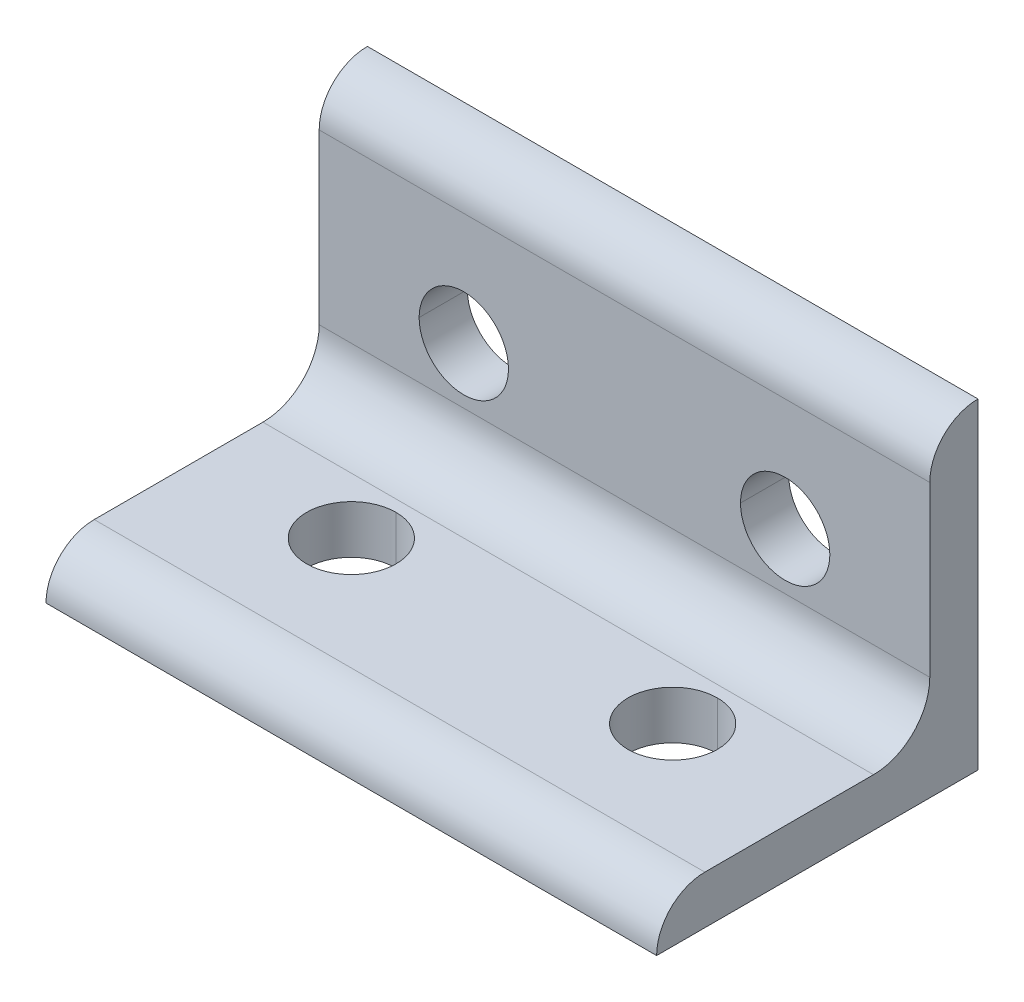
ISO-10303-21;
HEADER;
FILE_DESCRIPTION(('STEP AP214'),'2;1');
FILE_NAME('part.step','',(''),(''),'','','');
FILE_SCHEMA(('AUTOMOTIVE_DESIGN { 1 0 10303 214 1 1 1 1 }'));
ENDSEC;
DATA;
#1=APPLICATION_CONTEXT('core data for automotive mechanical design processes');
#2=APPLICATION_PROTOCOL_DEFINITION('international standard','automotive_design',2000,#1);
#3=PRODUCT_CONTEXT('',#1,'mechanical');
#4=PRODUCT('Part','Part','',(#3));
#5=PRODUCT_RELATED_PRODUCT_CATEGORY('part','',(#4));
#6=PRODUCT_DEFINITION_FORMATION('','',#4);
#7=PRODUCT_DEFINITION_CONTEXT('part definition',#1,'design');
#8=PRODUCT_DEFINITION('design','',#6,#7);
#9=PRODUCT_DEFINITION_SHAPE('','',#8);
#10=(LENGTH_UNIT() NAMED_UNIT(*) SI_UNIT(.MILLI.,.METRE.));
#11=(NAMED_UNIT(*) PLANE_ANGLE_UNIT() SI_UNIT($,.RADIAN.));
#12=(NAMED_UNIT(*) SI_UNIT($,.STERADIAN.) SOLID_ANGLE_UNIT());
#13=UNCERTAINTY_MEASURE_WITH_UNIT(LENGTH_MEASURE(1.E-05),#10,'distance_accuracy_value','');
#14=(GEOMETRIC_REPRESENTATION_CONTEXT(3) GLOBAL_UNCERTAINTY_ASSIGNED_CONTEXT((#13)) GLOBAL_UNIT_ASSIGNED_CONTEXT((#10,
#11,#12)) REPRESENTATION_CONTEXT('',''));
#15=CARTESIAN_POINT('',(0.,0.,0.));
#16=DIRECTION('',(0.,0.,1.));
#17=DIRECTION('',(1.,0.,0.));
#18=AXIS2_PLACEMENT_3D('',#15,#16,#17);
#19=CARTESIAN_POINT('',(19.,5.38631639290799E-13,17.0000000000006));
#20=DIRECTION('',(-1.,0.,0.));
#21=DIRECTION('',(0.,-0.707106781186549,-0.707106781186546));
#22=AXIS2_PLACEMENT_3D('',#19,#20,#21);
#23=CYLINDRICAL_SURFACE('',#22,2.99999999999946);
#24=CARTESIAN_POINT('',(-19.,5.38631639290799E-13,17.0000000000006));
#25=DIRECTION('',(1.,0.,0.));
#26=DIRECTION('',(0.,0.,-1.));
#27=AXIS2_PLACEMENT_3D('',#24,#25,#26);
#28=CIRCLE('',#27,2.99999999999946);
#29=CARTESIAN_POINT('',(-19.,3.,17.));
#30=VERTEX_POINT('',#29);
#31=CARTESIAN_POINT('',(-19.,0.,20.));
#32=VERTEX_POINT('',#31);
#33=EDGE_CURVE('E11',#30,#32,#28,.T.);
#34=ORIENTED_EDGE('',*,*,#33,.T.);
#35=DIRECTION('',(-1.,0.,0.));
#36=VECTOR('',#35,1.);
#37=CARTESIAN_POINT('',(19.,0.,20.));
#38=LINE('',#37,#36);
#39=CARTESIAN_POINT('',(19.,0.,20.));
#40=VERTEX_POINT('',#39);
#41=EDGE_CURVE('E24',#40,#32,#38,.T.);
#42=ORIENTED_EDGE('',*,*,#41,.F.);
#43=CARTESIAN_POINT('',(19.,5.38631639290799E-13,17.0000000000006));
#44=DIRECTION('',(1.,0.,0.));
#45=DIRECTION('',(0.,0.,-1.));
#46=AXIS2_PLACEMENT_3D('',#43,#44,#45);
#47=CIRCLE('',#46,2.99999999999946);
#48=CARTESIAN_POINT('',(19.,3.,17.));
#49=VERTEX_POINT('',#48);
#50=EDGE_CURVE('E297',#49,#40,#47,.T.);
#51=ORIENTED_EDGE('',*,*,#50,.F.);
#52=DIRECTION('',(-1.,0.,0.));
#53=VECTOR('',#52,1.);
#54=CARTESIAN_POINT('',(19.,3.,17.));
#55=LINE('',#54,#53);
#56=EDGE_CURVE('E293',#49,#30,#55,.T.);
#57=ORIENTED_EDGE('',*,*,#56,.T.);
#58=EDGE_LOOP('',(#34,#42,#51,#57));
#59=FACE_BOUND('',#58,.T.);
#60=ADVANCED_FACE('F16',(#59),#23,.T.);
#61=CARTESIAN_POINT('',(19.,3.,6.5));
#62=DIRECTION('',(0.,-1.,0.));
#63=DIRECTION('',(0.,0.,-1.));
#64=AXIS2_PLACEMENT_3D('',#61,#62,#63);
#65=PLANE('',#64);
#66=CARTESIAN_POINT('',(-10.,3.,10.));
#67=DIRECTION('',(0.,1.,0.));
#68=DIRECTION('',(0.,0.,-1.));
#69=AXIS2_PLACEMENT_3D('',#66,#67,#68);
#70=CIRCLE('',#69,2.78);
#71=CARTESIAN_POINT('',(-10.,3.,12.78));
#72=VERTEX_POINT('',#71);
#73=CARTESIAN_POINT('',(-10.,3.,7.22));
#74=VERTEX_POINT('',#73);
#75=EDGE_CURVE('E288',#72,#74,#70,.T.);
#76=ORIENTED_EDGE('',*,*,#75,.F.);
#77=CARTESIAN_POINT('',(-10.,3.,10.));
#78=DIRECTION('',(0.,1.,0.));
#79=DIRECTION('',(0.,0.,-1.));
#80=AXIS2_PLACEMENT_3D('',#77,#78,#79);
#81=CIRCLE('',#80,2.78);
#82=EDGE_CURVE('E283',#74,#72,#81,.T.);
#83=ORIENTED_EDGE('',*,*,#82,.F.);
#84=EDGE_LOOP('',(#76,#83));
#85=FACE_BOUND('',#84,.T.);
#86=CARTESIAN_POINT('',(10.,3.,10.));
#87=DIRECTION('',(0.,1.,0.));
#88=DIRECTION('',(0.,0.,-1.));
#89=AXIS2_PLACEMENT_3D('',#86,#87,#88);
#90=CIRCLE('',#89,2.78);
#91=CARTESIAN_POINT('',(10.,3.,12.78));
#92=VERTEX_POINT('',#91);
#93=CARTESIAN_POINT('',(10.,3.,7.22));
#94=VERTEX_POINT('',#93);
#95=EDGE_CURVE('E139',#92,#94,#90,.T.);
#96=ORIENTED_EDGE('',*,*,#95,.F.);
#97=CARTESIAN_POINT('',(10.,3.,10.));
#98=DIRECTION('',(0.,1.,0.));
#99=DIRECTION('',(0.,0.,-1.));
#100=AXIS2_PLACEMENT_3D('',#97,#98,#99);
#101=CIRCLE('',#100,2.78);
#102=EDGE_CURVE('E276',#94,#92,#101,.T.);
#103=ORIENTED_EDGE('',*,*,#102,.F.);
#104=EDGE_LOOP('',(#96,#103));
#105=FACE_BOUND('',#104,.T.);
#106=DIRECTION('',(0.,0.,1.));
#107=VECTOR('',#106,1.);
#108=CARTESIAN_POINT('',(-19.,3.,6.5));
#109=LINE('',#108,#107);
#110=CARTESIAN_POINT('',(-19.,3.,6.5));
#111=VERTEX_POINT('',#110);
#112=EDGE_CURVE('E271',#111,#30,#109,.T.);
#113=ORIENTED_EDGE('',*,*,#112,.T.);
#114=ORIENTED_EDGE('',*,*,#56,.F.);
#115=DIRECTION('',(0.,0.,1.));
#116=VECTOR('',#115,1.);
#117=CARTESIAN_POINT('',(19.,3.,6.5));
#118=LINE('',#117,#116);
#119=CARTESIAN_POINT('',(19.,3.,6.5));
#120=VERTEX_POINT('',#119);
#121=EDGE_CURVE('E266',#120,#49,#118,.T.);
#122=ORIENTED_EDGE('',*,*,#121,.F.);
#123=DIRECTION('',(-1.,0.,0.));
#124=VECTOR('',#123,1.);
#125=CARTESIAN_POINT('',(19.,3.,6.5));
#126=LINE('',#125,#124);
#127=EDGE_CURVE('E262',#120,#111,#126,.T.);
#128=ORIENTED_EDGE('',*,*,#127,.T.);
#129=EDGE_LOOP('',(#113,#114,#122,#128));
#130=FACE_BOUND('',#129,.T.);
#131=ADVANCED_FACE('F313',(#85,#105,#130),#65,.F.);
#132=CARTESIAN_POINT('',(19.,6.5,6.5));
#133=DIRECTION('',(-1.,0.,0.));
#134=DIRECTION('',(0.,0.707106781186547,0.707106781186548));
#135=AXIS2_PLACEMENT_3D('',#132,#133,#134);
#136=CYLINDRICAL_SURFACE('',#135,3.50000000000006);
#137=CARTESIAN_POINT('',(-19.,6.5,6.5));
#138=DIRECTION('',(1.,0.,0.));
#139=DIRECTION('',(0.,0.,-1.));
#140=AXIS2_PLACEMENT_3D('',#137,#138,#139);
#141=CIRCLE('',#140,3.50000000000006);
#142=CARTESIAN_POINT('',(-19.,6.5,3.));
#143=VERTEX_POINT('',#142);
#144=EDGE_CURVE('E257',#111,#143,#141,.T.);
#145=ORIENTED_EDGE('',*,*,#144,.F.);
#146=ORIENTED_EDGE('',*,*,#127,.F.);
#147=CARTESIAN_POINT('',(19.,6.5,6.5));
#148=DIRECTION('',(1.,0.,0.));
#149=DIRECTION('',(0.,0.,-1.));
#150=AXIS2_PLACEMENT_3D('',#147,#148,#149);
#151=CIRCLE('',#150,3.50000000000006);
#152=CARTESIAN_POINT('',(19.,6.5,3.));
#153=VERTEX_POINT('',#152);
#154=EDGE_CURVE('E253',#120,#153,#151,.T.);
#155=ORIENTED_EDGE('',*,*,#154,.T.);
#156=DIRECTION('',(-1.,0.,0.));
#157=VECTOR('',#156,1.);
#158=CARTESIAN_POINT('',(19.,6.5,3.));
#159=LINE('',#158,#157);
#160=EDGE_CURVE('E249',#153,#143,#159,.T.);
#161=ORIENTED_EDGE('',*,*,#160,.T.);
#162=EDGE_LOOP('',(#145,#146,#155,#161));
#163=FACE_BOUND('',#162,.T.);
#164=ADVANCED_FACE('F331',(#163),#136,.F.);
#165=CARTESIAN_POINT('',(19.,17.,3.));
#166=DIRECTION('',(0.,0.,-1.));
#167=DIRECTION('',(-1.,0.,0.));
#168=AXIS2_PLACEMENT_3D('',#165,#166,#167);
#169=PLANE('',#168);
#170=CARTESIAN_POINT('',(-10.,10.,3.));
#171=DIRECTION('',(0.,0.,1.));
#172=DIRECTION('',(-1.,0.,0.));
#173=AXIS2_PLACEMENT_3D('',#170,#171,#172);
#174=CIRCLE('',#173,2.78);
#175=CARTESIAN_POINT('',(-7.22,10.,3.));
#176=VERTEX_POINT('',#175);
#177=CARTESIAN_POINT('',(-12.78,10.,3.));
#178=VERTEX_POINT('',#177);
#179=EDGE_CURVE('E244',#176,#178,#174,.T.);
#180=ORIENTED_EDGE('',*,*,#179,.F.);
#181=CARTESIAN_POINT('',(-10.,10.,3.));
#182=DIRECTION('',(0.,0.,1.));
#183=DIRECTION('',(-1.,0.,0.));
#184=AXIS2_PLACEMENT_3D('',#181,#182,#183);
#185=CIRCLE('',#184,2.78);
#186=EDGE_CURVE('E239',#178,#176,#185,.T.);
#187=ORIENTED_EDGE('',*,*,#186,.F.);
#188=EDGE_LOOP('',(#180,#187));
#189=FACE_BOUND('',#188,.T.);
#190=CARTESIAN_POINT('',(10.,10.,3.));
#191=DIRECTION('',(0.,0.,1.));
#192=DIRECTION('',(-1.,0.,0.));
#193=AXIS2_PLACEMENT_3D('',#190,#191,#192);
#194=CIRCLE('',#193,2.78);
#195=CARTESIAN_POINT('',(12.78,10.,3.));
#196=VERTEX_POINT('',#195);
#197=CARTESIAN_POINT('',(7.22,10.,3.));
#198=VERTEX_POINT('',#197);
#199=EDGE_CURVE('E234',#196,#198,#194,.T.);
#200=ORIENTED_EDGE('',*,*,#199,.F.);
#201=CARTESIAN_POINT('',(10.,10.,3.));
#202=DIRECTION('',(0.,0.,1.));
#203=DIRECTION('',(-1.,0.,0.));
#204=AXIS2_PLACEMENT_3D('',#201,#202,#203);
#205=CIRCLE('',#204,2.78);
#206=EDGE_CURVE('E229',#198,#196,#205,.T.);
#207=ORIENTED_EDGE('',*,*,#206,.F.);
#208=EDGE_LOOP('',(#200,#207));
#209=FACE_BOUND('',#208,.T.);
#210=DIRECTION('',(0.,-1.,0.));
#211=VECTOR('',#210,1.);
#212=CARTESIAN_POINT('',(-19.,17.,3.));
#213=LINE('',#212,#211);
#214=CARTESIAN_POINT('',(-19.,17.,3.));
#215=VERTEX_POINT('',#214);
#216=EDGE_CURVE('E224',#215,#143,#213,.T.);
#217=ORIENTED_EDGE('',*,*,#216,.T.);
#218=ORIENTED_EDGE('',*,*,#160,.F.);
#219=DIRECTION('',(0.,-1.,0.));
#220=VECTOR('',#219,1.);
#221=CARTESIAN_POINT('',(19.,17.,3.));
#222=LINE('',#221,#220);
#223=CARTESIAN_POINT('',(19.,17.,3.));
#224=VERTEX_POINT('',#223);
#225=EDGE_CURVE('E219',#224,#153,#222,.T.);
#226=ORIENTED_EDGE('',*,*,#225,.F.);
#227=DIRECTION('',(-1.,0.,0.));
#228=VECTOR('',#227,1.);
#229=CARTESIAN_POINT('',(19.,17.,3.));
#230=LINE('',#229,#228);
#231=EDGE_CURVE('E215',#224,#215,#230,.T.);
#232=ORIENTED_EDGE('',*,*,#231,.T.);
#233=EDGE_LOOP('',(#217,#218,#226,#232));
#234=FACE_BOUND('',#233,.T.);
#235=ADVANCED_FACE('F329',(#189,#209,#234),#169,.F.);
#236=CARTESIAN_POINT('',(19.,17.0000000000006,5.38197958421804E-13));
#237=DIRECTION('',(-1.,0.,0.));
#238=DIRECTION('',(0.,-0.707106781186546,-0.707106781186549));
#239=AXIS2_PLACEMENT_3D('',#236,#237,#238);
#240=CYLINDRICAL_SURFACE('',#239,2.99999999999946);
#241=CARTESIAN_POINT('',(-19.,17.0000000000006,5.38197958421804E-13));
#242=DIRECTION('',(1.,0.,0.));
#243=DIRECTION('',(0.,0.,-1.));
#244=AXIS2_PLACEMENT_3D('',#241,#242,#243);
#245=CIRCLE('',#244,2.99999999999946);
#246=CARTESIAN_POINT('',(-19.,20.,0.));
#247=VERTEX_POINT('',#246);
#248=EDGE_CURVE('E210',#247,#215,#245,.T.);
#249=ORIENTED_EDGE('',*,*,#248,.T.);
#250=ORIENTED_EDGE('',*,*,#231,.F.);
#251=CARTESIAN_POINT('',(19.,17.0000000000006,5.38197958421804E-13));
#252=DIRECTION('',(1.,0.,0.));
#253=DIRECTION('',(0.,0.,-1.));
#254=AXIS2_PLACEMENT_3D('',#251,#252,#253);
#255=CIRCLE('',#254,2.99999999999946);
#256=CARTESIAN_POINT('',(19.,20.,0.));
#257=VERTEX_POINT('',#256);
#258=EDGE_CURVE('E205',#257,#224,#255,.T.);
#259=ORIENTED_EDGE('',*,*,#258,.F.);
#260=DIRECTION('',(-1.,0.,0.));
#261=VECTOR('',#260,1.);
#262=CARTESIAN_POINT('',(19.,20.,0.));
#263=LINE('',#262,#261);
#264=EDGE_CURVE('E201',#257,#247,#263,.T.);
#265=ORIENTED_EDGE('',*,*,#264,.T.);
#266=EDGE_LOOP('',(#249,#250,#259,#265));
#267=FACE_BOUND('',#266,.T.);
#268=ADVANCED_FACE('F327',(#267),#240,.T.);
#269=CARTESIAN_POINT('',(19.,0.,0.));
#270=DIRECTION('',(0.,0.,1.));
#271=DIRECTION('',(1.,0.,0.));
#272=AXIS2_PLACEMENT_3D('',#269,#270,#271);
#273=PLANE('',#272);
#274=CARTESIAN_POINT('',(-10.,10.,0.));
#275=DIRECTION('',(0.,0.,1.));
#276=DIRECTION('',(1.,0.,0.));
#277=AXIS2_PLACEMENT_3D('',#274,#275,#276);
#278=CIRCLE('',#277,2.78);
#279=CARTESIAN_POINT('',(-7.22,10.,0.));
#280=VERTEX_POINT('',#279);
#281=CARTESIAN_POINT('',(-12.78,10.,0.));
#282=VERTEX_POINT('',#281);
#283=EDGE_CURVE('E197',#280,#282,#278,.T.);
#284=ORIENTED_EDGE('',*,*,#283,.T.);
#285=CARTESIAN_POINT('',(-10.,10.,0.));
#286=DIRECTION('',(0.,0.,1.));
#287=DIRECTION('',(1.,0.,0.));
#288=AXIS2_PLACEMENT_3D('',#285,#286,#287);
#289=CIRCLE('',#288,2.78);
#290=EDGE_CURVE('E193',#282,#280,#289,.T.);
#291=ORIENTED_EDGE('',*,*,#290,.T.);
#292=EDGE_LOOP('',(#284,#291));
#293=FACE_BOUND('',#292,.T.);
#294=CARTESIAN_POINT('',(10.,10.,0.));
#295=DIRECTION('',(0.,0.,1.));
#296=DIRECTION('',(1.,0.,0.));
#297=AXIS2_PLACEMENT_3D('',#294,#295,#296);
#298=CIRCLE('',#297,2.78);
#299=CARTESIAN_POINT('',(12.78,10.,0.));
#300=VERTEX_POINT('',#299);
#301=CARTESIAN_POINT('',(7.22,10.,0.));
#302=VERTEX_POINT('',#301);
#303=EDGE_CURVE('E189',#300,#302,#298,.T.);
#304=ORIENTED_EDGE('',*,*,#303,.T.);
#305=CARTESIAN_POINT('',(10.,10.,0.));
#306=DIRECTION('',(0.,0.,1.));
#307=DIRECTION('',(1.,0.,0.));
#308=AXIS2_PLACEMENT_3D('',#305,#306,#307);
#309=CIRCLE('',#308,2.78);
#310=EDGE_CURVE('E185',#302,#300,#309,.T.);
#311=ORIENTED_EDGE('',*,*,#310,.T.);
#312=EDGE_LOOP('',(#304,#311));
#313=FACE_BOUND('',#312,.T.);
#314=DIRECTION('',(0.,1.,0.));
#315=VECTOR('',#314,1.);
#316=CARTESIAN_POINT('',(-19.,0.,0.));
#317=LINE('',#316,#315);
#318=CARTESIAN_POINT('',(-19.,0.,0.));
#319=VERTEX_POINT('',#318);
#320=EDGE_CURVE('E180',#319,#247,#317,.T.);
#321=ORIENTED_EDGE('',*,*,#320,.T.);
#322=ORIENTED_EDGE('',*,*,#264,.F.);
#323=DIRECTION('',(0.,1.,0.));
#324=VECTOR('',#323,1.);
#325=CARTESIAN_POINT('',(19.,0.,0.));
#326=LINE('',#325,#324);
#327=CARTESIAN_POINT('',(19.,0.,0.));
#328=VERTEX_POINT('',#327);
#329=EDGE_CURVE('E175',#328,#257,#326,.T.);
#330=ORIENTED_EDGE('',*,*,#329,.F.);
#331=DIRECTION('',(-1.,0.,0.));
#332=VECTOR('',#331,1.);
#333=CARTESIAN_POINT('',(19.,0.,0.));
#334=LINE('',#333,#332);
#335=EDGE_CURVE('E171',#328,#319,#334,.T.);
#336=ORIENTED_EDGE('',*,*,#335,.T.);
#337=EDGE_LOOP('',(#321,#322,#330,#336));
#338=FACE_BOUND('',#337,.T.);
#339=ADVANCED_FACE('F323',(#293,#313,#338),#273,.F.);
#340=CARTESIAN_POINT('',(19.,0.,20.));
#341=DIRECTION('',(0.,1.,0.));
#342=DIRECTION('',(0.,0.,1.));
#343=AXIS2_PLACEMENT_3D('',#340,#341,#342);
#344=PLANE('',#343);
#345=CARTESIAN_POINT('',(-10.,0.,10.));
#346=DIRECTION('',(0.,1.,0.));
#347=DIRECTION('',(1.,0.,0.));
#348=AXIS2_PLACEMENT_3D('',#345,#346,#347);
#349=CIRCLE('',#348,2.78);
#350=CARTESIAN_POINT('',(-10.,0.,7.22));
#351=VERTEX_POINT('',#350);
#352=CARTESIAN_POINT('',(-10.,0.,12.78));
#353=VERTEX_POINT('',#352);
#354=EDGE_CURVE('E167',#351,#353,#349,.T.);
#355=ORIENTED_EDGE('',*,*,#354,.T.);
#356=CARTESIAN_POINT('',(-10.,0.,10.));
#357=DIRECTION('',(0.,1.,0.));
#358=DIRECTION('',(0.,0.,1.));
#359=AXIS2_PLACEMENT_3D('',#356,#357,#358);
#360=CIRCLE('',#359,2.78);
#361=EDGE_CURVE('E136',#353,#351,#360,.T.);
#362=ORIENTED_EDGE('',*,*,#361,.T.);
#363=EDGE_LOOP('',(#355,#362));
#364=FACE_BOUND('',#363,.T.);
#365=CARTESIAN_POINT('',(10.,0.,10.));
#366=DIRECTION('',(0.,1.,0.));
#367=DIRECTION('',(1.,0.,0.));
#368=AXIS2_PLACEMENT_3D('',#365,#366,#367);
#369=CIRCLE('',#368,2.78);
#370=CARTESIAN_POINT('',(10.,0.,7.22));
#371=VERTEX_POINT('',#370);
#372=CARTESIAN_POINT('',(10.,0.,12.78));
#373=VERTEX_POINT('',#372);
#374=EDGE_CURVE('E122',#371,#373,#369,.T.);
#375=ORIENTED_EDGE('',*,*,#374,.T.);
#376=CARTESIAN_POINT('',(10.,0.,10.));
#377=DIRECTION('',(0.,1.,0.));
#378=DIRECTION('',(0.,0.,1.));
#379=AXIS2_PLACEMENT_3D('',#376,#377,#378);
#380=CIRCLE('',#379,2.78);
#381=EDGE_CURVE('E118',#373,#371,#380,.T.);
#382=ORIENTED_EDGE('',*,*,#381,.T.);
#383=EDGE_LOOP('',(#375,#382));
#384=FACE_BOUND('',#383,.T.);
#385=DIRECTION('',(0.,0.,-1.));
#386=VECTOR('',#385,1.);
#387=CARTESIAN_POINT('',(-19.,0.,20.));
#388=LINE('',#387,#386);
#389=EDGE_CURVE('E127',#32,#319,#388,.T.);
#390=ORIENTED_EDGE('',*,*,#389,.T.);
#391=ORIENTED_EDGE('',*,*,#335,.F.);
#392=DIRECTION('',(0.,0.,-1.));
#393=VECTOR('',#392,1.);
#394=CARTESIAN_POINT('',(19.,0.,20.));
#395=LINE('',#394,#393);
#396=EDGE_CURVE('E142',#40,#328,#395,.T.);
#397=ORIENTED_EDGE('',*,*,#396,.F.);
#398=ORIENTED_EDGE('',*,*,#41,.T.);
#399=EDGE_LOOP('',(#390,#391,#397,#398));
#400=FACE_BOUND('',#399,.T.);
#401=ADVANCED_FACE('F120',(#364,#384,#400),#344,.F.);
#402=CARTESIAN_POINT('',(19.,5.38631639290799E-13,17.0000000000006));
#403=DIRECTION('',(1.,0.,0.));
#404=DIRECTION('',(0.,0.,-1.));
#405=AXIS2_PLACEMENT_3D('',#402,#403,#404);
#406=PLANE('',#405);
#407=ORIENTED_EDGE('',*,*,#50,.T.);
#408=ORIENTED_EDGE('',*,*,#396,.T.);
#409=ORIENTED_EDGE('',*,*,#329,.T.);
#410=ORIENTED_EDGE('',*,*,#258,.T.);
#411=ORIENTED_EDGE('',*,*,#225,.T.);
#412=ORIENTED_EDGE('',*,*,#154,.F.);
#413=ORIENTED_EDGE('',*,*,#121,.T.);
#414=EDGE_LOOP('',(#407,#408,#409,#410,#411,#412,#413));
#415=FACE_BOUND('',#414,.T.);
#416=ADVANCED_FACE('F309',(#415),#406,.T.);
#417=CARTESIAN_POINT('',(-19.,5.38631639290799E-13,17.0000000000006));
#418=DIRECTION('',(1.,0.,0.));
#419=DIRECTION('',(0.,0.,-1.));
#420=AXIS2_PLACEMENT_3D('',#417,#418,#419);
#421=PLANE('',#420);
#422=ORIENTED_EDGE('',*,*,#33,.F.);
#423=ORIENTED_EDGE('',*,*,#112,.F.);
#424=ORIENTED_EDGE('',*,*,#144,.T.);
#425=ORIENTED_EDGE('',*,*,#216,.F.);
#426=ORIENTED_EDGE('',*,*,#248,.F.);
#427=ORIENTED_EDGE('',*,*,#320,.F.);
#428=ORIENTED_EDGE('',*,*,#389,.F.);
#429=EDGE_LOOP('',(#422,#423,#424,#425,#426,#427,#428));
#430=FACE_BOUND('',#429,.T.);
#431=ADVANCED_FACE('F318',(#430),#421,.F.);
#432=CARTESIAN_POINT('',(10.,3.1,10.));
#433=DIRECTION('',(0.,-1.,0.));
#434=DIRECTION('',(-1.,0.,0.));
#435=AXIS2_PLACEMENT_3D('',#432,#433,#434);
#436=CYLINDRICAL_SURFACE('',#435,2.78);
#437=DIRECTION('',(0.,-1.,0.));
#438=VECTOR('',#437,1.);
#439=CARTESIAN_POINT('',(10.,3.,12.78));
#440=LINE('',#439,#438);
#441=EDGE_CURVE('E135',#92,#373,#440,.T.);
#442=ORIENTED_EDGE('',*,*,#441,.F.);
#443=ORIENTED_EDGE('',*,*,#95,.T.);
#444=DIRECTION('',(0.,-1.,0.));
#445=VECTOR('',#444,1.);
#446=CARTESIAN_POINT('',(10.,3.,7.22));
#447=LINE('',#446,#445);
#448=EDGE_CURVE('E133',#94,#371,#447,.T.);
#449=ORIENTED_EDGE('',*,*,#448,.T.);
#450=ORIENTED_EDGE('',*,*,#381,.F.);
#451=EDGE_LOOP('',(#442,#443,#449,#450));
#452=FACE_BOUND('',#451,.T.);
#453=ADVANCED_FACE('F138',(#452),#436,.F.);
#454=CARTESIAN_POINT('',(10.,3.1,10.));
#455=DIRECTION('',(0.,-1.,0.));
#456=DIRECTION('',(1.,0.,0.));
#457=AXIS2_PLACEMENT_3D('',#454,#455,#456);
#458=CYLINDRICAL_SURFACE('',#457,2.78);
#459=ORIENTED_EDGE('',*,*,#441,.T.);
#460=ORIENTED_EDGE('',*,*,#374,.F.);
#461=ORIENTED_EDGE('',*,*,#448,.F.);
#462=ORIENTED_EDGE('',*,*,#102,.T.);
#463=EDGE_LOOP('',(#459,#460,#461,#462));
#464=FACE_BOUND('',#463,.T.);
#465=ADVANCED_FACE('F131',(#464),#458,.F.);
#466=CARTESIAN_POINT('',(-10.,3.1,10.));
#467=DIRECTION('',(0.,-1.,0.));
#468=DIRECTION('',(-1.,0.,0.));
#469=AXIS2_PLACEMENT_3D('',#466,#467,#468);
#470=CYLINDRICAL_SURFACE('',#469,2.78);
#471=DIRECTION('',(0.,-1.,0.));
#472=VECTOR('',#471,1.);
#473=CARTESIAN_POINT('',(-10.,3.,12.78));
#474=LINE('',#473,#472);
#475=EDGE_CURVE('E140',#72,#353,#474,.T.);
#476=ORIENTED_EDGE('',*,*,#475,.F.);
#477=ORIENTED_EDGE('',*,*,#75,.T.);
#478=DIRECTION('',(0.,-1.,0.));
#479=VECTOR('',#478,1.);
#480=CARTESIAN_POINT('',(-10.,3.,7.22));
#481=LINE('',#480,#479);
#482=EDGE_CURVE('E145',#74,#351,#481,.T.);
#483=ORIENTED_EDGE('',*,*,#482,.T.);
#484=ORIENTED_EDGE('',*,*,#361,.F.);
#485=EDGE_LOOP('',(#476,#477,#483,#484));
#486=FACE_BOUND('',#485,.T.);
#487=ADVANCED_FACE('F423',(#486),#470,.F.);
#488=CARTESIAN_POINT('',(-10.,3.1,10.));
#489=DIRECTION('',(0.,-1.,0.));
#490=DIRECTION('',(1.,0.,0.));
#491=AXIS2_PLACEMENT_3D('',#488,#489,#490);
#492=CYLINDRICAL_SURFACE('',#491,2.78);
#493=ORIENTED_EDGE('',*,*,#475,.T.);
#494=ORIENTED_EDGE('',*,*,#354,.F.);
#495=ORIENTED_EDGE('',*,*,#482,.F.);
#496=ORIENTED_EDGE('',*,*,#82,.T.);
#497=EDGE_LOOP('',(#493,#494,#495,#496));
#498=FACE_BOUND('',#497,.T.);
#499=ADVANCED_FACE('F432',(#498),#492,.F.);
#500=CARTESIAN_POINT('',(10.,10.,3.1));
#501=DIRECTION('',(0.,0.,-1.));
#502=DIRECTION('',(0.,1.,0.));
#503=AXIS2_PLACEMENT_3D('',#500,#501,#502);
#504=CYLINDRICAL_SURFACE('',#503,2.78);
#505=DIRECTION('',(0.,0.,-1.));
#506=VECTOR('',#505,1.);
#507=CARTESIAN_POINT('',(12.78,10.,3.));
#508=LINE('',#507,#506);
#509=EDGE_CURVE('E543',#196,#300,#508,.T.);
#510=ORIENTED_EDGE('',*,*,#509,.T.);
#511=ORIENTED_EDGE('',*,*,#310,.F.);
#512=DIRECTION('',(0.,0.,-1.));
#513=VECTOR('',#512,1.);
#514=CARTESIAN_POINT('',(7.22,10.,3.));
#515=LINE('',#514,#513);
#516=EDGE_CURVE('E533',#198,#302,#515,.T.);
#517=ORIENTED_EDGE('',*,*,#516,.F.);
#518=ORIENTED_EDGE('',*,*,#206,.T.);
#519=EDGE_LOOP('',(#510,#511,#517,#518));
#520=FACE_BOUND('',#519,.T.);
#521=ADVANCED_FACE('F442',(#520),#504,.F.);
#522=CARTESIAN_POINT('',(10.,10.,3.1));
#523=DIRECTION('',(0.,0.,-1.));
#524=DIRECTION('',(0.,-1.,0.));
#525=AXIS2_PLACEMENT_3D('',#522,#523,#524);
#526=CYLINDRICAL_SURFACE('',#525,2.78);
#527=ORIENTED_EDGE('',*,*,#509,.F.);
#528=ORIENTED_EDGE('',*,*,#199,.T.);
#529=ORIENTED_EDGE('',*,*,#516,.T.);
#530=ORIENTED_EDGE('',*,*,#303,.F.);
#531=EDGE_LOOP('',(#527,#528,#529,#530));
#532=FACE_BOUND('',#531,.T.);
#533=ADVANCED_FACE('F452',(#532),#526,.F.);
#534=CARTESIAN_POINT('',(-10.,10.,3.1));
#535=DIRECTION('',(0.,0.,-1.));
#536=DIRECTION('',(0.,1.,0.));
#537=AXIS2_PLACEMENT_3D('',#534,#535,#536);
#538=CYLINDRICAL_SURFACE('',#537,2.78);
#539=DIRECTION('',(0.,0.,-1.));
#540=VECTOR('',#539,1.);
#541=CARTESIAN_POINT('',(-7.22,10.,3.));
#542=LINE('',#541,#540);
#543=EDGE_CURVE('E530',#176,#280,#542,.T.);
#544=ORIENTED_EDGE('',*,*,#543,.T.);
#545=ORIENTED_EDGE('',*,*,#290,.F.);
#546=DIRECTION('',(0.,0.,-1.));
#547=VECTOR('',#546,1.);
#548=CARTESIAN_POINT('',(-12.78,10.,3.));
#549=LINE('',#548,#547);
#550=EDGE_CURVE('E534',#178,#282,#549,.T.);
#551=ORIENTED_EDGE('',*,*,#550,.F.);
#552=ORIENTED_EDGE('',*,*,#186,.T.);
#553=EDGE_LOOP('',(#544,#545,#551,#552));
#554=FACE_BOUND('',#553,.T.);
#555=ADVANCED_FACE('F462',(#554),#538,.F.);
#556=CARTESIAN_POINT('',(-10.,10.,3.1));
#557=DIRECTION('',(0.,0.,-1.));
#558=DIRECTION('',(0.,-1.,0.));
#559=AXIS2_PLACEMENT_3D('',#556,#557,#558);
#560=CYLINDRICAL_SURFACE('',#559,2.78);
#561=ORIENTED_EDGE('',*,*,#543,.F.);
#562=ORIENTED_EDGE('',*,*,#179,.T.);
#563=ORIENTED_EDGE('',*,*,#550,.T.);
#564=ORIENTED_EDGE('',*,*,#283,.F.);
#565=EDGE_LOOP('',(#561,#562,#563,#564));
#566=FACE_BOUND('',#565,.T.);
#567=ADVANCED_FACE('F472',(#566),#560,.F.);
#568=CLOSED_SHELL('',(#60,#131,#164,#235,#268,#339,#401,#416,#431,#453,#465,#487,#499,#521,#533,
#555,#567));
#569=MANIFOLD_SOLID_BREP('B1',#568);
#570=ADVANCED_BREP_SHAPE_REPRESENTATION('',(#18,#569),#14);
#571=SHAPE_DEFINITION_REPRESENTATION(#9,#570);
ENDSEC;
END-ISO-10303-21;
